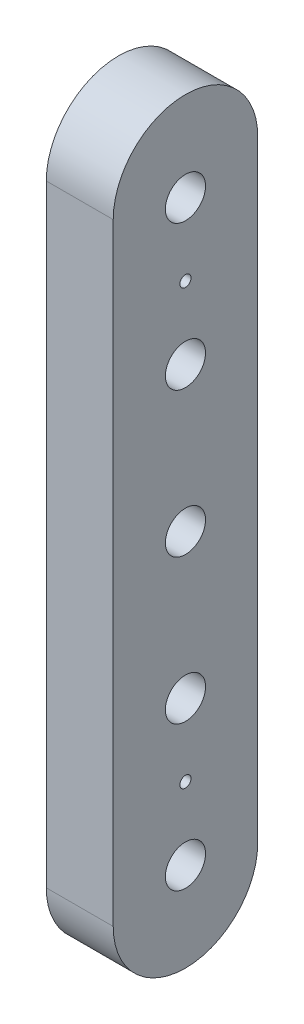
ISO-10303-21;
HEADER;
FILE_DESCRIPTION(('STEP AP214'),'2;1');
FILE_NAME('part.step','',(''),(''),'','','');
FILE_SCHEMA(('AUTOMOTIVE_DESIGN { 1 0 10303 214 1 1 1 1 }'));
ENDSEC;
DATA;
#1=APPLICATION_CONTEXT('core data for automotive mechanical design processes');
#2=APPLICATION_PROTOCOL_DEFINITION('international standard','automotive_design',2000,#1);
#3=PRODUCT_CONTEXT('',#1,'mechanical');
#4=PRODUCT('Part','Part','',(#3));
#5=PRODUCT_RELATED_PRODUCT_CATEGORY('part','',(#4));
#6=PRODUCT_DEFINITION_FORMATION('','',#4);
#7=PRODUCT_DEFINITION_CONTEXT('part definition',#1,'design');
#8=PRODUCT_DEFINITION('design','',#6,#7);
#9=PRODUCT_DEFINITION_SHAPE('','',#8);
#10=(LENGTH_UNIT() NAMED_UNIT(*) SI_UNIT(.MILLI.,.METRE.));
#11=(NAMED_UNIT(*) PLANE_ANGLE_UNIT() SI_UNIT($,.RADIAN.));
#12=(NAMED_UNIT(*) SI_UNIT($,.STERADIAN.) SOLID_ANGLE_UNIT());
#13=UNCERTAINTY_MEASURE_WITH_UNIT(LENGTH_MEASURE(1.E-05),#10,'distance_accuracy_value','');
#14=(GEOMETRIC_REPRESENTATION_CONTEXT(3) GLOBAL_UNCERTAINTY_ASSIGNED_CONTEXT((#13)) GLOBAL_UNIT_ASSIGNED_CONTEXT((#10,
#11,#12)) REPRESENTATION_CONTEXT('',''));
#15=CARTESIAN_POINT('',(0.,0.,0.));
#16=DIRECTION('',(0.,0.,1.));
#17=DIRECTION('',(1.,0.,0.));
#18=AXIS2_PLACEMENT_3D('',#15,#16,#17);
#19=CARTESIAN_POINT('',(990.146797213117,2028.05100619535,-164.79980395356));
#20=DIRECTION('',(1.,0.,0.));
#21=DIRECTION('',(0.,0.,-1.));
#22=AXIS2_PLACEMENT_3D('',#19,#20,#21);
#23=CYLINDRICAL_SURFACE('',#22,82.24980395356);
#24=CARTESIAN_POINT('',(1066.34679721312,2028.05100619535,-164.79980395356));
#25=DIRECTION('',(-1.,0.,0.));
#26=DIRECTION('',(0.,0.,1.));
#27=AXIS2_PLACEMENT_3D('',#24,#25,#26);
#28=CIRCLE('',#27,82.24980395356);
#29=CARTESIAN_POINT('',(1066.34679721312,2028.05100619535,-82.5500000000004));
#30=VERTEX_POINT('',#29);
#31=CARTESIAN_POINT('',(1066.34679721312,2028.05100619535,-247.04960790712));
#32=VERTEX_POINT('',#31);
#33=EDGE_CURVE('E99',#30,#32,#28,.T.);
#34=ORIENTED_EDGE('',*,*,#33,.T.);
#35=DIRECTION('',(1.,0.,0.));
#36=VECTOR('',#35,1.);
#37=CARTESIAN_POINT('',(990.146797213117,2028.05100619535,-247.04960790712));
#38=LINE('',#37,#36);
#39=CARTESIAN_POINT('',(990.146797213117,2028.05100619535,-247.04960790712));
#40=VERTEX_POINT('',#39);
#41=EDGE_CURVE('E11',#40,#32,#38,.T.);
#42=ORIENTED_EDGE('',*,*,#41,.F.);
#43=CARTESIAN_POINT('',(990.146797213117,2028.05100619535,-164.79980395356));
#44=DIRECTION('',(-1.,0.,0.));
#45=DIRECTION('',(0.,0.,1.));
#46=AXIS2_PLACEMENT_3D('',#43,#44,#45);
#47=CIRCLE('',#46,82.24980395356);
#48=CARTESIAN_POINT('',(990.146797213117,2028.05100619535,-82.5500000000004));
#49=VERTEX_POINT('',#48);
#50=EDGE_CURVE('E87',#49,#40,#47,.T.);
#51=ORIENTED_EDGE('',*,*,#50,.F.);
#52=DIRECTION('',(1.,0.,0.));
#53=VECTOR('',#52,1.);
#54=CARTESIAN_POINT('',(990.146797213117,2028.05100619535,-82.5500000000004));
#55=LINE('',#54,#53);
#56=EDGE_CURVE('E95',#49,#30,#55,.T.);
#57=ORIENTED_EDGE('',*,*,#56,.T.);
#58=EDGE_LOOP('',(#34,#42,#51,#57));
#59=FACE_BOUND('',#58,.T.);
#60=ADVANCED_FACE('F36',(#59),#23,.T.);
#61=CARTESIAN_POINT('',(990.146797213117,2028.05100619535,-247.04960790712));
#62=DIRECTION('',(0.,0.,1.));
#63=DIRECTION('',(0.,-1.,0.));
#64=AXIS2_PLACEMENT_3D('',#61,#62,#63);
#65=PLANE('',#64);
#66=DIRECTION('',(0.,-1.,0.));
#67=VECTOR('',#66,1.);
#68=CARTESIAN_POINT('',(1066.34679721312,2028.05100619535,-247.04960790712));
#69=LINE('',#68,#67);
#70=CARTESIAN_POINT('',(1066.34679721312,1331.16375694592,-247.049607907121));
#71=VERTEX_POINT('',#70);
#72=EDGE_CURVE('E91',#32,#71,#69,.T.);
#73=ORIENTED_EDGE('',*,*,#72,.T.);
#74=DIRECTION('',(1.,0.,0.));
#75=VECTOR('',#74,1.);
#76=CARTESIAN_POINT('',(990.146797213117,1331.16375694592,-247.049607907121));
#77=LINE('',#76,#75);
#78=CARTESIAN_POINT('',(990.146797213117,1331.16375694592,-247.049607907121));
#79=VERTEX_POINT('',#78);
#80=EDGE_CURVE('E44',#79,#71,#77,.T.);
#81=ORIENTED_EDGE('',*,*,#80,.F.);
#82=DIRECTION('',(0.,-1.,0.));
#83=VECTOR('',#82,1.);
#84=CARTESIAN_POINT('',(990.146797213117,2028.05100619535,-247.04960790712));
#85=LINE('',#84,#83);
#86=EDGE_CURVE('E82',#40,#79,#85,.T.);
#87=ORIENTED_EDGE('',*,*,#86,.F.);
#88=ORIENTED_EDGE('',*,*,#41,.T.);
#89=EDGE_LOOP('',(#73,#81,#87,#88));
#90=FACE_BOUND('',#89,.T.);
#91=ADVANCED_FACE('F90',(#90),#65,.F.);
#92=CARTESIAN_POINT('',(990.146797213117,1331.16375694592,-164.79980395356));
#93=DIRECTION('',(1.,0.,0.));
#94=DIRECTION('',(0.,0.,-1.));
#95=AXIS2_PLACEMENT_3D('',#92,#93,#94);
#96=CYLINDRICAL_SURFACE('',#95,82.2498039535603);
#97=CARTESIAN_POINT('',(1066.34679721312,1331.16375694592,-164.79980395356));
#98=DIRECTION('',(-1.,0.,0.));
#99=DIRECTION('',(0.,0.,1.));
#100=AXIS2_PLACEMENT_3D('',#97,#98,#99);
#101=CIRCLE('',#100,82.2498039535603);
#102=CARTESIAN_POINT('',(1066.34679721312,1331.16375694592,-82.5499999999999));
#103=VERTEX_POINT('',#102);
#104=EDGE_CURVE('E69',#71,#103,#101,.T.);
#105=ORIENTED_EDGE('',*,*,#104,.T.);
#106=DIRECTION('',(1.,0.,0.));
#107=VECTOR('',#106,1.);
#108=CARTESIAN_POINT('',(990.146797213117,1331.16375694592,-82.5499999999999));
#109=LINE('',#108,#107);
#110=CARTESIAN_POINT('',(990.146797213117,1331.16375694592,-82.5499999999999));
#111=VERTEX_POINT('',#110);
#112=EDGE_CURVE('E92',#111,#103,#109,.T.);
#113=ORIENTED_EDGE('',*,*,#112,.F.);
#114=CARTESIAN_POINT('',(990.146797213117,1331.16375694592,-164.79980395356));
#115=DIRECTION('',(-1.,0.,0.));
#116=DIRECTION('',(0.,0.,1.));
#117=AXIS2_PLACEMENT_3D('',#114,#115,#116);
#118=CIRCLE('',#117,82.2498039535603);
#119=EDGE_CURVE('E85',#79,#111,#118,.T.);
#120=ORIENTED_EDGE('',*,*,#119,.F.);
#121=ORIENTED_EDGE('',*,*,#80,.T.);
#122=EDGE_LOOP('',(#105,#113,#120,#121));
#123=FACE_BOUND('',#122,.T.);
#124=ADVANCED_FACE('F93',(#123),#96,.T.);
#125=CARTESIAN_POINT('',(990.146797213117,1331.16375694592,-82.5499999999999));
#126=DIRECTION('',(0.,0.,-1.));
#127=DIRECTION('',(0.,1.,0.));
#128=AXIS2_PLACEMENT_3D('',#125,#126,#127);
#129=PLANE('',#128);
#130=DIRECTION('',(0.,1.,0.));
#131=VECTOR('',#130,1.);
#132=CARTESIAN_POINT('',(1066.34679721312,1331.16375694592,-82.5499999999999));
#133=LINE('',#132,#131);
#134=EDGE_CURVE('E75',#103,#30,#133,.T.);
#135=ORIENTED_EDGE('',*,*,#134,.T.);
#136=ORIENTED_EDGE('',*,*,#56,.F.);
#137=DIRECTION('',(0.,1.,0.));
#138=VECTOR('',#137,1.);
#139=CARTESIAN_POINT('',(990.146797213117,1331.16375694592,-82.5499999999999));
#140=LINE('',#139,#138);
#141=EDGE_CURVE('E52',#111,#49,#140,.T.);
#142=ORIENTED_EDGE('',*,*,#141,.F.);
#143=ORIENTED_EDGE('',*,*,#112,.T.);
#144=EDGE_LOOP('',(#135,#136,#142,#143));
#145=FACE_BOUND('',#144,.T.);
#146=ADVANCED_FACE('F107',(#145),#129,.F.);
#147=CARTESIAN_POINT('',(990.146797213117,2028.05100619535,-164.79980395356));
#148=DIRECTION('',(-1.,0.,0.));
#149=DIRECTION('',(0.,0.,1.));
#150=AXIS2_PLACEMENT_3D('',#147,#148,#149);
#151=PLANE('',#150);
#152=CARTESIAN_POINT('',(990.146797213117,1432.78731013693,-164.79980395356));
#153=DIRECTION('',(-1.,0.,0.));
#154=DIRECTION('',(0.,0.,1.));
#155=AXIS2_PLACEMENT_3D('',#152,#153,#154);
#156=CIRCLE('',#155,6.35000000000002);
#157=CARTESIAN_POINT('',(990.146797213117,1432.78731013693,-158.44980395356));
#158=VERTEX_POINT('',#157);
#159=EDGE_CURVE('E149',#158,#158,#156,.F.);
#160=ORIENTED_EDGE('',*,*,#159,.T.);
#161=EDGE_LOOP('',(#160));
#162=FACE_BOUND('',#161,.T.);
#163=CARTESIAN_POINT('',(990.146797213117,1926.42745300434,-164.79980395356));
#164=DIRECTION('',(-1.,0.,0.));
#165=DIRECTION('',(0.,0.,1.));
#166=AXIS2_PLACEMENT_3D('',#163,#164,#165);
#167=CIRCLE('',#166,6.35000000000002);
#168=CARTESIAN_POINT('',(990.146797213117,1926.42745300434,-158.44980395356));
#169=VERTEX_POINT('',#168);
#170=EDGE_CURVE('E143',#169,#169,#167,.F.);
#171=ORIENTED_EDGE('',*,*,#170,.T.);
#172=EDGE_LOOP('',(#171));
#173=FACE_BOUND('',#172,.T.);
#174=CARTESIAN_POINT('',(990.146797213117,1350.51395299236,-164.79980395356));
#175=DIRECTION('',(-1.,0.,0.));
#176=DIRECTION('',(0.,0.,1.));
#177=AXIS2_PLACEMENT_3D('',#174,#175,#176);
#178=CIRCLE('',#177,22.86);
#179=CARTESIAN_POINT('',(990.146797213117,1350.51395299236,-141.93980395356));
#180=VERTEX_POINT('',#179);
#181=EDGE_CURVE('E137',#180,#180,#178,.F.);
#182=ORIENTED_EDGE('',*,*,#181,.T.);
#183=EDGE_LOOP('',(#182));
#184=FACE_BOUND('',#183,.T.);
#185=CARTESIAN_POINT('',(990.146797213117,1515.0606672815,-164.79980395356));
#186=DIRECTION('',(-1.,0.,0.));
#187=DIRECTION('',(0.,0.,1.));
#188=AXIS2_PLACEMENT_3D('',#185,#186,#187);
#189=CIRCLE('',#188,22.86);
#190=CARTESIAN_POINT('',(990.146797213117,1515.0606672815,-141.93980395356));
#191=VERTEX_POINT('',#190);
#192=EDGE_CURVE('E131',#191,#191,#189,.F.);
#193=ORIENTED_EDGE('',*,*,#192,.T.);
#194=EDGE_LOOP('',(#193));
#195=FACE_BOUND('',#194,.T.);
#196=CARTESIAN_POINT('',(990.146797213117,2008.70081014891,-164.79980395356));
#197=DIRECTION('',(-1.,0.,0.));
#198=DIRECTION('',(0.,0.,1.));
#199=AXIS2_PLACEMENT_3D('',#196,#197,#198);
#200=CIRCLE('',#199,22.86);
#201=CARTESIAN_POINT('',(990.146797213117,2008.70081014891,-141.93980395356));
#202=VERTEX_POINT('',#201);
#203=EDGE_CURVE('E125',#202,#202,#200,.F.);
#204=ORIENTED_EDGE('',*,*,#203,.T.);
#205=EDGE_LOOP('',(#204));
#206=FACE_BOUND('',#205,.T.);
#207=CARTESIAN_POINT('',(990.146797213117,1679.60738157062,-164.79980395356));
#208=DIRECTION('',(-1.,0.,0.));
#209=DIRECTION('',(0.,0.,1.));
#210=AXIS2_PLACEMENT_3D('',#207,#208,#209);
#211=CIRCLE('',#210,22.860000000004);
#212=CARTESIAN_POINT('',(990.146797213117,1679.60738157062,-141.939803953556));
#213=VERTEX_POINT('',#212);
#214=EDGE_CURVE('E119',#213,#213,#211,.F.);
#215=ORIENTED_EDGE('',*,*,#214,.T.);
#216=EDGE_LOOP('',(#215));
#217=FACE_BOUND('',#216,.T.);
#218=CARTESIAN_POINT('',(990.146797213117,1844.15409585977,-164.79980395356));
#219=DIRECTION('',(-1.,0.,0.));
#220=DIRECTION('',(0.,0.,1.));
#221=AXIS2_PLACEMENT_3D('',#218,#219,#220);
#222=CIRCLE('',#221,22.86);
#223=CARTESIAN_POINT('',(990.146797213117,1844.15409585977,-141.93980395356));
#224=VERTEX_POINT('',#223);
#225=EDGE_CURVE('E113',#224,#224,#222,.F.);
#226=ORIENTED_EDGE('',*,*,#225,.T.);
#227=EDGE_LOOP('',(#226));
#228=FACE_BOUND('',#227,.T.);
#229=ORIENTED_EDGE('',*,*,#50,.T.);
#230=ORIENTED_EDGE('',*,*,#86,.T.);
#231=ORIENTED_EDGE('',*,*,#119,.T.);
#232=ORIENTED_EDGE('',*,*,#141,.T.);
#233=EDGE_LOOP('',(#229,#230,#231,#232));
#234=FACE_BOUND('',#233,.T.);
#235=ADVANCED_FACE('F83',(#162,#173,#184,#195,#206,#217,#228,#234),#151,.T.);
#236=CARTESIAN_POINT('',(1066.34679721312,2028.05100619535,-164.79980395356));
#237=DIRECTION('',(-1.,0.,0.));
#238=DIRECTION('',(0.,0.,1.));
#239=AXIS2_PLACEMENT_3D('',#236,#237,#238);
#240=PLANE('',#239);
#241=CARTESIAN_POINT('',(1066.34679721312,1432.78731013693,-164.79980395356));
#242=DIRECTION('',(1.,0.,0.));
#243=DIRECTION('',(0.,0.,-1.));
#244=AXIS2_PLACEMENT_3D('',#241,#242,#243);
#245=CIRCLE('',#244,6.35000000000002);
#246=CARTESIAN_POINT('',(1066.34679721312,1432.78731013693,-171.14980395356));
#247=VERTEX_POINT('',#246);
#248=EDGE_CURVE('E146',#247,#247,#245,.T.);
#249=ORIENTED_EDGE('',*,*,#248,.F.);
#250=EDGE_LOOP('',(#249));
#251=FACE_BOUND('',#250,.T.);
#252=CARTESIAN_POINT('',(1066.34679721312,1926.42745300434,-164.79980395356));
#253=DIRECTION('',(1.,0.,0.));
#254=DIRECTION('',(0.,0.,-1.));
#255=AXIS2_PLACEMENT_3D('',#252,#253,#254);
#256=CIRCLE('',#255,6.35000000000002);
#257=CARTESIAN_POINT('',(1066.34679721312,1926.42745300434,-171.14980395356));
#258=VERTEX_POINT('',#257);
#259=EDGE_CURVE('E140',#258,#258,#256,.T.);
#260=ORIENTED_EDGE('',*,*,#259,.F.);
#261=EDGE_LOOP('',(#260));
#262=FACE_BOUND('',#261,.T.);
#263=CARTESIAN_POINT('',(1066.34679721312,1350.51395299236,-164.79980395356));
#264=DIRECTION('',(1.,0.,0.));
#265=DIRECTION('',(0.,0.,-1.));
#266=AXIS2_PLACEMENT_3D('',#263,#264,#265);
#267=CIRCLE('',#266,22.86);
#268=CARTESIAN_POINT('',(1066.34679721312,1350.51395299236,-187.65980395356));
#269=VERTEX_POINT('',#268);
#270=EDGE_CURVE('E134',#269,#269,#267,.T.);
#271=ORIENTED_EDGE('',*,*,#270,.F.);
#272=EDGE_LOOP('',(#271));
#273=FACE_BOUND('',#272,.T.);
#274=CARTESIAN_POINT('',(1066.34679721312,1515.0606672815,-164.79980395356));
#275=DIRECTION('',(1.,0.,0.));
#276=DIRECTION('',(0.,0.,-1.));
#277=AXIS2_PLACEMENT_3D('',#274,#275,#276);
#278=CIRCLE('',#277,22.86);
#279=CARTESIAN_POINT('',(1066.34679721312,1515.0606672815,-187.65980395356));
#280=VERTEX_POINT('',#279);
#281=EDGE_CURVE('E128',#280,#280,#278,.T.);
#282=ORIENTED_EDGE('',*,*,#281,.F.);
#283=EDGE_LOOP('',(#282));
#284=FACE_BOUND('',#283,.T.);
#285=CARTESIAN_POINT('',(1066.34679721312,2008.70081014891,-164.79980395356));
#286=DIRECTION('',(1.,0.,0.));
#287=DIRECTION('',(0.,0.,-1.));
#288=AXIS2_PLACEMENT_3D('',#285,#286,#287);
#289=CIRCLE('',#288,22.86);
#290=CARTESIAN_POINT('',(1066.34679721312,2008.70081014891,-187.65980395356));
#291=VERTEX_POINT('',#290);
#292=EDGE_CURVE('E122',#291,#291,#289,.T.);
#293=ORIENTED_EDGE('',*,*,#292,.F.);
#294=EDGE_LOOP('',(#293));
#295=FACE_BOUND('',#294,.T.);
#296=CARTESIAN_POINT('',(1066.34679721312,1679.60738157062,-164.79980395356));
#297=DIRECTION('',(1.,0.,0.));
#298=DIRECTION('',(0.,0.,-1.));
#299=AXIS2_PLACEMENT_3D('',#296,#297,#298);
#300=CIRCLE('',#299,22.860000000004);
#301=CARTESIAN_POINT('',(1066.34679721312,1679.60738157062,-187.659803953564));
#302=VERTEX_POINT('',#301);
#303=EDGE_CURVE('E116',#302,#302,#300,.T.);
#304=ORIENTED_EDGE('',*,*,#303,.F.);
#305=EDGE_LOOP('',(#304));
#306=FACE_BOUND('',#305,.T.);
#307=CARTESIAN_POINT('',(1066.34679721312,1844.15409585977,-164.79980395356));
#308=DIRECTION('',(1.,0.,0.));
#309=DIRECTION('',(0.,0.,-1.));
#310=AXIS2_PLACEMENT_3D('',#307,#308,#309);
#311=CIRCLE('',#310,22.86);
#312=CARTESIAN_POINT('',(1066.34679721312,1844.15409585977,-187.65980395356));
#313=VERTEX_POINT('',#312);
#314=EDGE_CURVE('E102',#313,#313,#311,.T.);
#315=ORIENTED_EDGE('',*,*,#314,.F.);
#316=EDGE_LOOP('',(#315));
#317=FACE_BOUND('',#316,.T.);
#318=ORIENTED_EDGE('',*,*,#33,.F.);
#319=ORIENTED_EDGE('',*,*,#134,.F.);
#320=ORIENTED_EDGE('',*,*,#104,.F.);
#321=ORIENTED_EDGE('',*,*,#72,.F.);
#322=EDGE_LOOP('',(#318,#319,#320,#321));
#323=FACE_BOUND('',#322,.T.);
#324=ADVANCED_FACE('F110',(#251,#262,#273,#284,#295,#306,#317,#323),#240,.F.);
#325=CARTESIAN_POINT('',(990.145797213117,1844.15409585977,-164.79980395356));
#326=DIRECTION('',(1.,0.,0.));
#327=DIRECTION('',(0.,0.,-1.));
#328=AXIS2_PLACEMENT_3D('',#325,#326,#327);
#329=CYLINDRICAL_SURFACE('',#328,22.86);
#330=ORIENTED_EDGE('',*,*,#225,.F.);
#331=EDGE_LOOP('',(#330));
#332=FACE_BOUND('',#331,.T.);
#333=ORIENTED_EDGE('',*,*,#314,.T.);
#334=EDGE_LOOP('',(#333));
#335=FACE_BOUND('',#334,.T.);
#336=ADVANCED_FACE('F159',(#332,#335),#329,.F.);
#337=CARTESIAN_POINT('',(990.145797213117,1679.60738157062,-164.79980395356));
#338=DIRECTION('',(1.,0.,0.));
#339=DIRECTION('',(0.,0.,-1.));
#340=AXIS2_PLACEMENT_3D('',#337,#338,#339);
#341=CYLINDRICAL_SURFACE('',#340,22.860000000004);
#342=ORIENTED_EDGE('',*,*,#214,.F.);
#343=EDGE_LOOP('',(#342));
#344=FACE_BOUND('',#343,.T.);
#345=ORIENTED_EDGE('',*,*,#303,.T.);
#346=EDGE_LOOP('',(#345));
#347=FACE_BOUND('',#346,.T.);
#348=ADVANCED_FACE('F174',(#344,#347),#341,.F.);
#349=CARTESIAN_POINT('',(990.145797213117,2008.70081014891,-164.79980395356));
#350=DIRECTION('',(1.,0.,0.));
#351=DIRECTION('',(0.,0.,-1.));
#352=AXIS2_PLACEMENT_3D('',#349,#350,#351);
#353=CYLINDRICAL_SURFACE('',#352,22.86);
#354=ORIENTED_EDGE('',*,*,#203,.F.);
#355=EDGE_LOOP('',(#354));
#356=FACE_BOUND('',#355,.T.);
#357=ORIENTED_EDGE('',*,*,#292,.T.);
#358=EDGE_LOOP('',(#357));
#359=FACE_BOUND('',#358,.T.);
#360=ADVANCED_FACE('F180',(#356,#359),#353,.F.);
#361=CARTESIAN_POINT('',(990.145797213117,1515.0606672815,-164.79980395356));
#362=DIRECTION('',(1.,0.,0.));
#363=DIRECTION('',(0.,0.,-1.));
#364=AXIS2_PLACEMENT_3D('',#361,#362,#363);
#365=CYLINDRICAL_SURFACE('',#364,22.86);
#366=ORIENTED_EDGE('',*,*,#192,.F.);
#367=EDGE_LOOP('',(#366));
#368=FACE_BOUND('',#367,.T.);
#369=ORIENTED_EDGE('',*,*,#281,.T.);
#370=EDGE_LOOP('',(#369));
#371=FACE_BOUND('',#370,.T.);
#372=ADVANCED_FACE('F215',(#368,#371),#365,.F.);
#373=CARTESIAN_POINT('',(990.145797213117,1350.51395299236,-164.79980395356));
#374=DIRECTION('',(1.,0.,0.));
#375=DIRECTION('',(0.,0.,-1.));
#376=AXIS2_PLACEMENT_3D('',#373,#374,#375);
#377=CYLINDRICAL_SURFACE('',#376,22.86);
#378=ORIENTED_EDGE('',*,*,#181,.F.);
#379=EDGE_LOOP('',(#378));
#380=FACE_BOUND('',#379,.T.);
#381=ORIENTED_EDGE('',*,*,#270,.T.);
#382=EDGE_LOOP('',(#381));
#383=FACE_BOUND('',#382,.T.);
#384=ADVANCED_FACE('F220',(#380,#383),#377,.F.);
#385=CARTESIAN_POINT('',(990.145797213117,1926.42745300434,-164.79980395356));
#386=DIRECTION('',(1.,0.,0.));
#387=DIRECTION('',(0.,0.,-1.));
#388=AXIS2_PLACEMENT_3D('',#385,#386,#387);
#389=CYLINDRICAL_SURFACE('',#388,6.35000000000002);
#390=ORIENTED_EDGE('',*,*,#170,.F.);
#391=EDGE_LOOP('',(#390));
#392=FACE_BOUND('',#391,.T.);
#393=ORIENTED_EDGE('',*,*,#259,.T.);
#394=EDGE_LOOP('',(#393));
#395=FACE_BOUND('',#394,.T.);
#396=ADVANCED_FACE('F226',(#392,#395),#389,.F.);
#397=CARTESIAN_POINT('',(990.145797213117,1432.78731013693,-164.79980395356));
#398=DIRECTION('',(1.,0.,0.));
#399=DIRECTION('',(0.,0.,-1.));
#400=AXIS2_PLACEMENT_3D('',#397,#398,#399);
#401=CYLINDRICAL_SURFACE('',#400,6.35000000000002);
#402=ORIENTED_EDGE('',*,*,#159,.F.);
#403=EDGE_LOOP('',(#402));
#404=FACE_BOUND('',#403,.T.);
#405=ORIENTED_EDGE('',*,*,#248,.T.);
#406=EDGE_LOOP('',(#405));
#407=FACE_BOUND('',#406,.T.);
#408=ADVANCED_FACE('F155',(#404,#407),#401,.F.);
#409=CLOSED_SHELL('',(#60,#91,#124,#146,#235,#324,#336,#348,#360,#372,#384,#396,#408));
#410=MANIFOLD_SOLID_BREP('B2',#409);
#411=ADVANCED_BREP_SHAPE_REPRESENTATION('',(#18,#410),#14);
#412=SHAPE_DEFINITION_REPRESENTATION(#9,#411);
ENDSEC;
END-ISO-10303-21;
